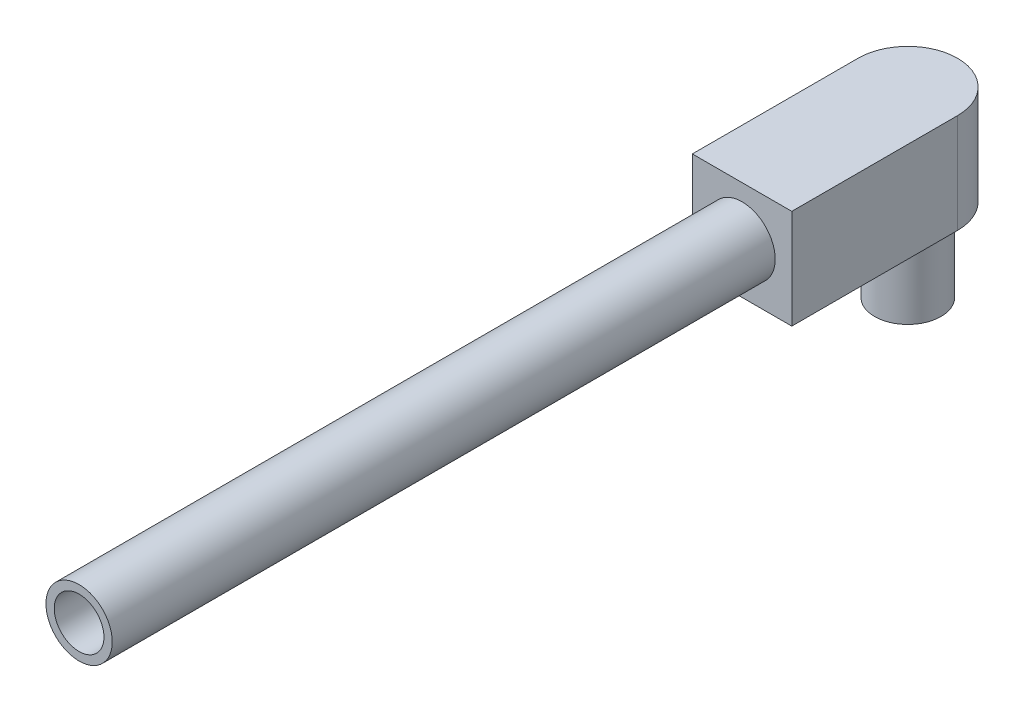
ISO-10303-21;
HEADER;
FILE_DESCRIPTION(('STEP AP214'),'2;1');
FILE_NAME('part.step','',(''),(''),'','','');
FILE_SCHEMA(('AUTOMOTIVE_DESIGN { 1 0 10303 214 1 1 1 1 }'));
ENDSEC;
DATA;
#1=APPLICATION_CONTEXT('core data for automotive mechanical design processes');
#2=APPLICATION_PROTOCOL_DEFINITION('international standard','automotive_design',2000,#1);
#3=PRODUCT_CONTEXT('',#1,'mechanical');
#4=PRODUCT('Part','Part','',(#3));
#5=PRODUCT_RELATED_PRODUCT_CATEGORY('part','',(#4));
#6=PRODUCT_DEFINITION_FORMATION('','',#4);
#7=PRODUCT_DEFINITION_CONTEXT('part definition',#1,'design');
#8=PRODUCT_DEFINITION('design','',#6,#7);
#9=PRODUCT_DEFINITION_SHAPE('','',#8);
#10=(LENGTH_UNIT() NAMED_UNIT(*) SI_UNIT(.MILLI.,.METRE.));
#11=(NAMED_UNIT(*) PLANE_ANGLE_UNIT() SI_UNIT($,.RADIAN.));
#12=(NAMED_UNIT(*) SI_UNIT($,.STERADIAN.) SOLID_ANGLE_UNIT());
#13=UNCERTAINTY_MEASURE_WITH_UNIT(LENGTH_MEASURE(1.E-05),#10,'distance_accuracy_value','');
#14=(GEOMETRIC_REPRESENTATION_CONTEXT(3) GLOBAL_UNCERTAINTY_ASSIGNED_CONTEXT((#13)) GLOBAL_UNIT_ASSIGNED_CONTEXT((#10,
#11,#12)) REPRESENTATION_CONTEXT('',''));
#15=CARTESIAN_POINT('',(0.,0.,0.));
#16=DIRECTION('',(0.,0.,1.));
#17=DIRECTION('',(1.,0.,0.));
#18=AXIS2_PLACEMENT_3D('',#15,#16,#17);
#19=CARTESIAN_POINT('',(-15.,-15.,5.));
#20=DIRECTION('',(1.,0.,0.));
#21=DIRECTION('',(0.,1.,0.));
#22=AXIS2_PLACEMENT_3D('',#19,#20,#21);
#23=PLANE('',#22);
#24=DIRECTION('',(0.,-1.,0.));
#25=VECTOR('',#24,1.);
#26=CARTESIAN_POINT('',(-15.,15.,-45.));
#27=LINE('',#26,#25);
#28=CARTESIAN_POINT('',(-15.,15.,-45.));
#29=VERTEX_POINT('',#28);
#30=CARTESIAN_POINT('',(-15.,-15.,-45.));
#31=VERTEX_POINT('',#30);
#32=EDGE_CURVE('E53',#29,#31,#27,.T.);
#33=ORIENTED_EDGE('',*,*,#32,.T.);
#34=DIRECTION('',(0.,0.,-1.));
#35=VECTOR('',#34,1.);
#36=CARTESIAN_POINT('',(-15.,-15.,5.));
#37=LINE('',#36,#35);
#38=CARTESIAN_POINT('',(-15.,-15.,5.));
#39=VERTEX_POINT('',#38);
#40=EDGE_CURVE('E100',#39,#31,#37,.T.);
#41=ORIENTED_EDGE('',*,*,#40,.F.);
#42=DIRECTION('',(0.,-1.,0.));
#43=VECTOR('',#42,1.);
#44=CARTESIAN_POINT('',(-15.,-15.,5.));
#45=LINE('',#44,#43);
#46=CARTESIAN_POINT('',(-15.,15.,5.));
#47=VERTEX_POINT('',#46);
#48=EDGE_CURVE('E144',#47,#39,#45,.T.);
#49=ORIENTED_EDGE('',*,*,#48,.F.);
#50=DIRECTION('',(0.,0.,-1.));
#51=VECTOR('',#50,1.);
#52=CARTESIAN_POINT('',(-15.,15.,5.));
#53=LINE('',#52,#51);
#54=EDGE_CURVE('E98',#47,#29,#53,.T.);
#55=ORIENTED_EDGE('',*,*,#54,.T.);
#56=EDGE_LOOP('',(#33,#41,#49,#55));
#57=FACE_BOUND('',#56,.T.);
#58=ADVANCED_FACE('F39',(#57),#23,.F.);
#59=CARTESIAN_POINT('',(15.,-15.,5.));
#60=DIRECTION('',(0.,1.,0.));
#61=DIRECTION('',(-1.,0.,0.));
#62=AXIS2_PLACEMENT_3D('',#59,#60,#61);
#63=PLANE('',#62);
#64=CARTESIAN_POINT('',(0.,-15.,-45.));
#65=DIRECTION('',(0.,1.,0.));
#66=DIRECTION('',(-1.,0.,0.));
#67=AXIS2_PLACEMENT_3D('',#64,#65,#66);
#68=CIRCLE('',#67,10.);
#69=CARTESIAN_POINT('',(-10.,-15.,-45.));
#70=VERTEX_POINT('',#69);
#71=EDGE_CURVE('E12',#70,#70,#68,.F.);
#72=ORIENTED_EDGE('',*,*,#71,.F.);
#73=EDGE_LOOP('',(#72));
#74=FACE_BOUND('',#73,.T.);
#75=ORIENTED_EDGE('',*,*,#40,.T.);
#76=CARTESIAN_POINT('',(0.,-15.,-45.));
#77=DIRECTION('',(0.,1.,0.));
#78=DIRECTION('',(1.,0.,0.));
#79=AXIS2_PLACEMENT_3D('',#76,#77,#78);
#80=CIRCLE('',#79,15.);
#81=CARTESIAN_POINT('',(15.,-15.,-45.));
#82=VERTEX_POINT('',#81);
#83=EDGE_CURVE('E86',#82,#31,#80,.T.);
#84=ORIENTED_EDGE('',*,*,#83,.F.);
#85=DIRECTION('',(0.,0.,-1.));
#86=VECTOR('',#85,1.);
#87=CARTESIAN_POINT('',(15.,-15.,5.));
#88=LINE('',#87,#86);
#89=CARTESIAN_POINT('',(15.,-15.,5.));
#90=VERTEX_POINT('',#89);
#91=EDGE_CURVE('E94',#90,#82,#88,.T.);
#92=ORIENTED_EDGE('',*,*,#91,.F.);
#93=DIRECTION('',(1.,0.,0.));
#94=VECTOR('',#93,1.);
#95=CARTESIAN_POINT('',(15.,-15.,5.));
#96=LINE('',#95,#94);
#97=EDGE_CURVE('E142',#39,#90,#96,.T.);
#98=ORIENTED_EDGE('',*,*,#97,.F.);
#99=EDGE_LOOP('',(#75,#84,#92,#98));
#100=FACE_BOUND('',#99,.T.);
#101=ADVANCED_FACE('F132',(#74,#100),#63,.F.);
#102=CARTESIAN_POINT('',(15.,-15.,5.));
#103=DIRECTION('',(-1.,0.,0.));
#104=DIRECTION('',(0.,0.,1.));
#105=AXIS2_PLACEMENT_3D('',#102,#103,#104);
#106=PLANE('',#105);
#107=ORIENTED_EDGE('',*,*,#91,.T.);
#108=DIRECTION('',(0.,-1.,0.));
#109=VECTOR('',#108,1.);
#110=CARTESIAN_POINT('',(15.,15.,-45.));
#111=LINE('',#110,#109);
#112=CARTESIAN_POINT('',(15.,15.,-45.));
#113=VERTEX_POINT('',#112);
#114=EDGE_CURVE('E81',#113,#82,#111,.T.);
#115=ORIENTED_EDGE('',*,*,#114,.F.);
#116=DIRECTION('',(0.,0.,-1.));
#117=VECTOR('',#116,1.);
#118=CARTESIAN_POINT('',(15.,15.,5.));
#119=LINE('',#118,#117);
#120=CARTESIAN_POINT('',(15.,15.,5.));
#121=VERTEX_POINT('',#120);
#122=EDGE_CURVE('E92',#121,#113,#119,.T.);
#123=ORIENTED_EDGE('',*,*,#122,.F.);
#124=DIRECTION('',(0.,1.,0.));
#125=VECTOR('',#124,1.);
#126=CARTESIAN_POINT('',(15.,-15.,5.));
#127=LINE('',#126,#125);
#128=EDGE_CURVE('E143',#90,#121,#127,.T.);
#129=ORIENTED_EDGE('',*,*,#128,.F.);
#130=EDGE_LOOP('',(#107,#115,#123,#129));
#131=FACE_BOUND('',#130,.T.);
#132=ADVANCED_FACE('F90',(#131),#106,.F.);
#133=CARTESIAN_POINT('',(15.,15.,5.));
#134=DIRECTION('',(0.,-1.,0.));
#135=DIRECTION('',(1.,0.,0.));
#136=AXIS2_PLACEMENT_3D('',#133,#134,#135);
#137=PLANE('',#136);
#138=ORIENTED_EDGE('',*,*,#122,.T.);
#139=CARTESIAN_POINT('',(0.,15.,-45.));
#140=DIRECTION('',(0.,1.,0.));
#141=DIRECTION('',(1.,0.,0.));
#142=AXIS2_PLACEMENT_3D('',#139,#140,#141);
#143=CIRCLE('',#142,15.);
#144=EDGE_CURVE('E78',#113,#29,#143,.T.);
#145=ORIENTED_EDGE('',*,*,#144,.T.);
#146=ORIENTED_EDGE('',*,*,#54,.F.);
#147=DIRECTION('',(-1.,0.,0.));
#148=VECTOR('',#147,1.);
#149=CARTESIAN_POINT('',(15.,15.,5.));
#150=LINE('',#149,#148);
#151=EDGE_CURVE('E61',#121,#47,#150,.T.);
#152=ORIENTED_EDGE('',*,*,#151,.F.);
#153=EDGE_LOOP('',(#138,#145,#146,#152));
#154=FACE_BOUND('',#153,.T.);
#155=ADVANCED_FACE('F97',(#154),#137,.F.);
#156=CARTESIAN_POINT('',(0.,0.,5.));
#157=DIRECTION('',(0.,0.,1.));
#158=DIRECTION('',(1.,0.,0.));
#159=AXIS2_PLACEMENT_3D('',#156,#157,#158);
#160=PLANE('',#159);
#161=CARTESIAN_POINT('',(0.,0.,5.));
#162=DIRECTION('',(0.,0.,1.));
#163=DIRECTION('',(1.,0.,0.));
#164=AXIS2_PLACEMENT_3D('',#161,#162,#163);
#165=CIRCLE('',#164,10.);
#166=CARTESIAN_POINT('',(10.,0.,5.));
#167=VERTEX_POINT('',#166);
#168=EDGE_CURVE('E149',#167,#167,#165,.T.);
#169=ORIENTED_EDGE('',*,*,#168,.F.);
#170=EDGE_LOOP('',(#169));
#171=FACE_BOUND('',#170,.T.);
#172=ORIENTED_EDGE('',*,*,#48,.T.);
#173=ORIENTED_EDGE('',*,*,#97,.T.);
#174=ORIENTED_EDGE('',*,*,#128,.T.);
#175=ORIENTED_EDGE('',*,*,#151,.T.);
#176=EDGE_LOOP('',(#172,#173,#174,#175));
#177=FACE_BOUND('',#176,.T.);
#178=ADVANCED_FACE('F115',(#171,#177),#160,.T.);
#179=CARTESIAN_POINT('',(0.,0.,205.));
#180=DIRECTION('',(0.,0.,1.));
#181=DIRECTION('',(1.,0.,0.));
#182=AXIS2_PLACEMENT_3D('',#179,#180,#181);
#183=PLANE('',#182);
#184=CARTESIAN_POINT('',(0.,0.,205.));
#185=DIRECTION('',(0.,0.,1.));
#186=DIRECTION('',(1.,0.,0.));
#187=AXIS2_PLACEMENT_3D('',#184,#185,#186);
#188=CIRCLE('',#187,10.);
#189=CARTESIAN_POINT('',(10.,0.,205.));
#190=VERTEX_POINT('',#189);
#191=EDGE_CURVE('E146',#190,#190,#188,.T.);
#192=ORIENTED_EDGE('',*,*,#191,.T.);
#193=EDGE_LOOP('',(#192));
#194=FACE_BOUND('',#193,.T.);
#195=CARTESIAN_POINT('',(0.,0.,205.));
#196=DIRECTION('',(0.,0.,1.));
#197=DIRECTION('',(1.,0.,0.));
#198=AXIS2_PLACEMENT_3D('',#195,#196,#197);
#199=CIRCLE('',#198,7.5);
#200=CARTESIAN_POINT('',(7.5,0.,205.));
#201=VERTEX_POINT('',#200);
#202=EDGE_CURVE('E154',#201,#201,#199,.T.);
#203=ORIENTED_EDGE('',*,*,#202,.F.);
#204=EDGE_LOOP('',(#203));
#205=FACE_BOUND('',#204,.T.);
#206=ADVANCED_FACE('F129',(#194,#205),#183,.T.);
#207=CARTESIAN_POINT('',(0.,0.,205.));
#208=DIRECTION('',(0.,0.,-1.));
#209=DIRECTION('',(-1.,0.,0.));
#210=AXIS2_PLACEMENT_3D('',#207,#208,#209);
#211=CYLINDRICAL_SURFACE('',#210,10.);
#212=ORIENTED_EDGE('',*,*,#191,.F.);
#213=EDGE_LOOP('',(#212));
#214=FACE_BOUND('',#213,.T.);
#215=ORIENTED_EDGE('',*,*,#168,.T.);
#216=EDGE_LOOP('',(#215));
#217=FACE_BOUND('',#216,.T.);
#218=ADVANCED_FACE('F123',(#214,#217),#211,.T.);
#219=CARTESIAN_POINT('',(0.,0.,205.));
#220=DIRECTION('',(0.,0.,-1.));
#221=DIRECTION('',(-1.,0.,0.));
#222=AXIS2_PLACEMENT_3D('',#219,#220,#221);
#223=CYLINDRICAL_SURFACE('',#222,7.5);
#224=ORIENTED_EDGE('',*,*,#202,.T.);
#225=EDGE_LOOP('',(#224));
#226=FACE_BOUND('',#225,.T.);
#227=CARTESIAN_POINT('',(0.,0.,5.));
#228=DIRECTION('',(0.,0.,1.));
#229=DIRECTION('',(1.,0.,0.));
#230=AXIS2_PLACEMENT_3D('',#227,#228,#229);
#231=CIRCLE('',#230,7.5);
#232=CARTESIAN_POINT('',(7.5,0.,5.));
#233=VERTEX_POINT('',#232);
#234=EDGE_CURVE('E46',#233,#233,#231,.F.);
#235=ORIENTED_EDGE('',*,*,#234,.T.);
#236=EDGE_LOOP('',(#235));
#237=FACE_BOUND('',#236,.T.);
#238=ADVANCED_FACE('F109',(#226,#237),#223,.F.);
#239=ORIENTED_EDGE('',*,*,#234,.F.);
#240=EDGE_LOOP('',(#239));
#241=FACE_BOUND('',#240,.T.);
#242=ADVANCED_FACE('F111',(#241),#160,.T.);
#243=CARTESIAN_POINT('',(0.,-40.,-45.));
#244=DIRECTION('',(0.,1.,0.));
#245=DIRECTION('',(-1.,0.,0.));
#246=AXIS2_PLACEMENT_3D('',#243,#244,#245);
#247=CYLINDRICAL_SURFACE('',#246,10.);
#248=CARTESIAN_POINT('',(0.,-40.,-45.));
#249=DIRECTION('',(0.,-1.,0.));
#250=DIRECTION('',(1.,0.,0.));
#251=AXIS2_PLACEMENT_3D('',#248,#249,#250);
#252=CIRCLE('',#251,10.);
#253=CARTESIAN_POINT('',(10.,-40.,-45.));
#254=VERTEX_POINT('',#253);
#255=EDGE_CURVE('E95',#254,#254,#252,.T.);
#256=ORIENTED_EDGE('',*,*,#255,.F.);
#257=EDGE_LOOP('',(#256));
#258=FACE_BOUND('',#257,.T.);
#259=ORIENTED_EDGE('',*,*,#71,.T.);
#260=EDGE_LOOP('',(#259));
#261=FACE_BOUND('',#260,.T.);
#262=ADVANCED_FACE('F113',(#258,#261),#247,.T.);
#263=CARTESIAN_POINT('',(0.,-40.,-45.));
#264=DIRECTION('',(0.,-1.,0.));
#265=DIRECTION('',(1.,0.,0.));
#266=AXIS2_PLACEMENT_3D('',#263,#264,#265);
#267=PLANE('',#266);
#268=ORIENTED_EDGE('',*,*,#255,.T.);
#269=EDGE_LOOP('',(#268));
#270=FACE_BOUND('',#269,.T.);
#271=ADVANCED_FACE('F120',(#270),#267,.T.);
#272=CARTESIAN_POINT('',(0.,15.,-45.));
#273=DIRECTION('',(0.,-1.,0.));
#274=DIRECTION('',(1.,0.,0.));
#275=AXIS2_PLACEMENT_3D('',#272,#273,#274);
#276=CYLINDRICAL_SURFACE('',#275,15.);
#277=ORIENTED_EDGE('',*,*,#83,.T.);
#278=ORIENTED_EDGE('',*,*,#32,.F.);
#279=ORIENTED_EDGE('',*,*,#144,.F.);
#280=ORIENTED_EDGE('',*,*,#114,.T.);
#281=EDGE_LOOP('',(#277,#278,#279,#280));
#282=FACE_BOUND('',#281,.T.);
#283=ADVANCED_FACE('F80',(#282),#276,.T.);
#284=CLOSED_SHELL('',(#58,#101,#132,#155,#178,#206,#218,#238,#242,#262,#271,#283));
#285=MANIFOLD_SOLID_BREP('B2',#284);
#286=ADVANCED_BREP_SHAPE_REPRESENTATION('',(#18,#285),#14);
#287=SHAPE_DEFINITION_REPRESENTATION(#9,#286);
ENDSEC;
END-ISO-10303-21;
